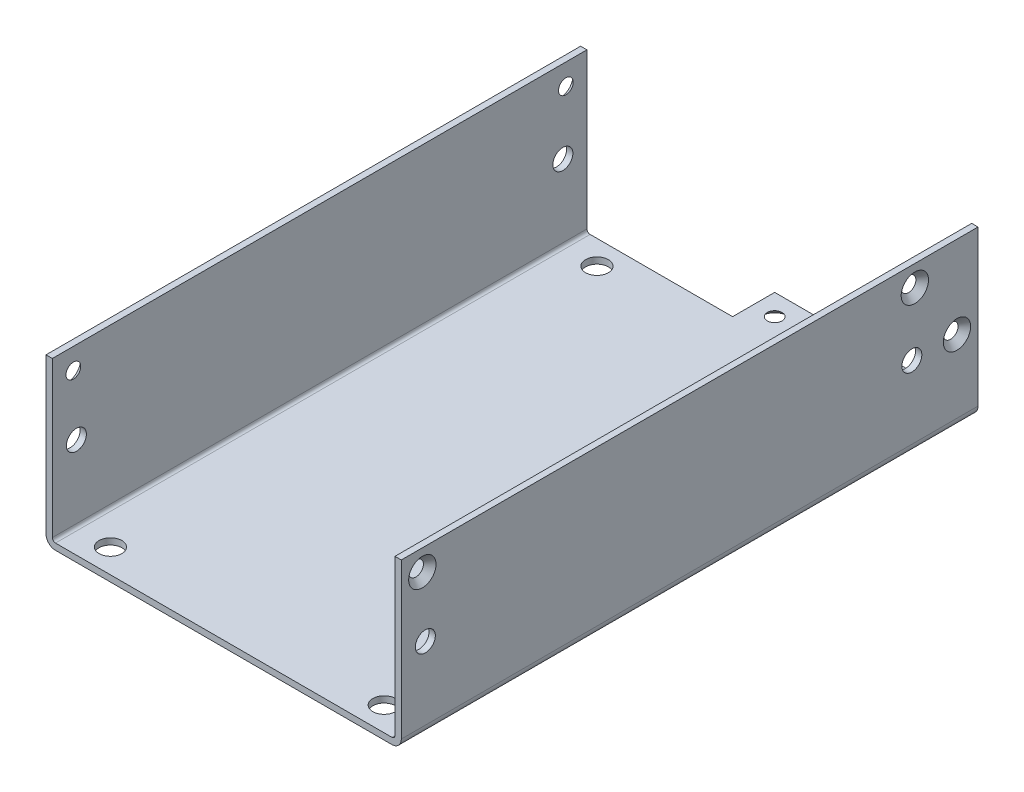
ISO-10303-21;
HEADER;
FILE_DESCRIPTION(('STEP AP214'),'2;1');
FILE_NAME('part.step','',(''),(''),'','','');
FILE_SCHEMA(('AUTOMOTIVE_DESIGN { 1 0 10303 214 1 1 1 1 }'));
ENDSEC;
DATA;
#1=APPLICATION_CONTEXT('core data for automotive mechanical design processes');
#2=APPLICATION_PROTOCOL_DEFINITION('international standard','automotive_design',2000,#1);
#3=PRODUCT_CONTEXT('',#1,'mechanical');
#4=PRODUCT('Part','Part','',(#3));
#5=PRODUCT_RELATED_PRODUCT_CATEGORY('part','',(#4));
#6=PRODUCT_DEFINITION_FORMATION('','',#4);
#7=PRODUCT_DEFINITION_CONTEXT('part definition',#1,'design');
#8=PRODUCT_DEFINITION('design','',#6,#7);
#9=PRODUCT_DEFINITION_SHAPE('','',#8);
#10=(LENGTH_UNIT() NAMED_UNIT(*) SI_UNIT(.MILLI.,.METRE.));
#11=(NAMED_UNIT(*) PLANE_ANGLE_UNIT() SI_UNIT($,.RADIAN.));
#12=(NAMED_UNIT(*) SI_UNIT($,.STERADIAN.) SOLID_ANGLE_UNIT());
#13=UNCERTAINTY_MEASURE_WITH_UNIT(LENGTH_MEASURE(1.E-05),#10,'distance_accuracy_value','');
#14=(GEOMETRIC_REPRESENTATION_CONTEXT(3) GLOBAL_UNCERTAINTY_ASSIGNED_CONTEXT((#13)) GLOBAL_UNIT_ASSIGNED_CONTEXT((#10,
#11,#12)) REPRESENTATION_CONTEXT('',''));
#15=CARTESIAN_POINT('',(0.,0.,0.));
#16=DIRECTION('',(0.,0.,1.));
#17=DIRECTION('',(1.,0.,0.));
#18=AXIS2_PLACEMENT_3D('',#15,#16,#17);
#19=CARTESIAN_POINT('',(-42.2,-29.1000000000002,127.));
#20=DIRECTION('',(0.,1.,0.));
#21=DIRECTION('',(0.,0.,1.));
#22=AXIS2_PLACEMENT_3D('',#19,#20,#21);
#23=PLANE('',#22);
#24=CARTESIAN_POINT('',(-1.09999999999999,-29.099999999922,-5.));
#25=DIRECTION('',(0.,-1.,0.));
#26=DIRECTION('',(0.,0.,-1.));
#27=AXIS2_PLACEMENT_3D('',#24,#25,#26);
#28=CIRCLE('',#27,1.74999999995406);
#29=CARTESIAN_POINT('',(-1.09999999999999,-29.099999999922,-6.74999999995406));
#30=VERTEX_POINT('',#29);
#31=EDGE_CURVE('E11',#30,#30,#28,.T.);
#32=ORIENTED_EDGE('',*,*,#31,.T.);
#33=EDGE_LOOP('',(#32));
#34=FACE_BOUND('',#33,.T.);
#35=CARTESIAN_POINT('',(-32.6,-29.1000000000002,5.71500000000001));
#36=DIRECTION('',(0.,-1.,0.));
#37=DIRECTION('',(0.,0.,1.));
#38=AXIS2_PLACEMENT_3D('',#35,#36,#37);
#39=CIRCLE('',#38,2.70000000000001);
#40=CARTESIAN_POINT('',(-32.6,-29.1000000000002,8.41500000000002));
#41=VERTEX_POINT('',#40);
#42=EDGE_CURVE('E27',#41,#41,#39,.T.);
#43=ORIENTED_EDGE('',*,*,#42,.T.);
#44=EDGE_LOOP('',(#43));
#45=FACE_BOUND('',#44,.T.);
#46=CARTESIAN_POINT('',(-32.6,-29.1000000000002,121.285));
#47=DIRECTION('',(0.,-1.,0.));
#48=DIRECTION('',(0.,0.,1.));
#49=AXIS2_PLACEMENT_3D('',#46,#47,#48);
#50=CIRCLE('',#49,2.69999999999999);
#51=CARTESIAN_POINT('',(-32.6,-29.1000000000002,123.985));
#52=VERTEX_POINT('',#51);
#53=EDGE_CURVE('E319',#52,#52,#50,.T.);
#54=ORIENTED_EDGE('',*,*,#53,.T.);
#55=EDGE_LOOP('',(#54));
#56=FACE_BOUND('',#55,.T.);
#57=CARTESIAN_POINT('',(32.42,-29.1000000000002,121.285));
#58=DIRECTION('',(0.,-1.,0.));
#59=DIRECTION('',(0.,0.,1.));
#60=AXIS2_PLACEMENT_3D('',#57,#58,#59);
#61=CIRCLE('',#60,2.69999999999999);
#62=CARTESIAN_POINT('',(32.42,-29.1000000000002,123.985));
#63=VERTEX_POINT('',#62);
#64=EDGE_CURVE('E323',#63,#63,#61,.T.);
#65=ORIENTED_EDGE('',*,*,#64,.T.);
#66=EDGE_LOOP('',(#65));
#67=FACE_BOUND('',#66,.T.);
#68=CARTESIAN_POINT('',(32.42,-29.1000000000002,5.71500000000001));
#69=DIRECTION('',(0.,-1.,0.));
#70=DIRECTION('',(0.,0.,1.));
#71=AXIS2_PLACEMENT_3D('',#68,#69,#70);
#72=CIRCLE('',#71,2.7);
#73=CARTESIAN_POINT('',(32.42,-29.1000000000002,8.41500000000001));
#74=VERTEX_POINT('',#73);
#75=EDGE_CURVE('E320',#74,#74,#72,.T.);
#76=ORIENTED_EDGE('',*,*,#75,.T.);
#77=EDGE_LOOP('',(#76));
#78=FACE_BOUND('',#77,.T.);
#79=DIRECTION('',(-1.,0.,0.));
#80=VECTOR('',#79,1.);
#81=CARTESIAN_POINT('',(-42.2,-29.1000000000002,-10.));
#82=LINE('',#81,#80);
#83=CARTESIAN_POINT('',(39.95,-29.1000000000002,-10.));
#84=VERTEX_POINT('',#83);
#85=CARTESIAN_POINT('',(-6.09999999999999,-29.1000000000002,-10.));
#86=VERTEX_POINT('',#85);
#87=EDGE_CURVE('E324',#84,#86,#82,.T.);
#88=ORIENTED_EDGE('',*,*,#87,.T.);
#89=DIRECTION('',(0.,0.,1.));
#90=VECTOR('',#89,1.);
#91=CARTESIAN_POINT('',(-6.09999999999999,-29.1000000000002,127.));
#92=LINE('',#91,#90);
#93=CARTESIAN_POINT('',(-6.09999999999999,-29.1000000000002,0.));
#94=VERTEX_POINT('',#93);
#95=EDGE_CURVE('E403',#86,#94,#92,.T.);
#96=ORIENTED_EDGE('',*,*,#95,.T.);
#97=DIRECTION('',(-1.,0.,0.));
#98=VECTOR('',#97,1.);
#99=CARTESIAN_POINT('',(-42.2,-29.1000000000002,0.));
#100=LINE('',#99,#98);
#101=CARTESIAN_POINT('',(-39.95,-29.1000000000002,0.));
#102=VERTEX_POINT('',#101);
#103=EDGE_CURVE('E343',#94,#102,#100,.T.);
#104=ORIENTED_EDGE('',*,*,#103,.T.);
#105=DIRECTION('',(0.,0.,1.));
#106=VECTOR('',#105,1.);
#107=CARTESIAN_POINT('',(-39.95,-29.1000000000002,127.));
#108=LINE('',#107,#106);
#109=CARTESIAN_POINT('',(-39.95,-29.1000000000002,127.));
#110=VERTEX_POINT('',#109);
#111=EDGE_CURVE('E340',#102,#110,#108,.T.);
#112=ORIENTED_EDGE('',*,*,#111,.T.);
#113=DIRECTION('',(1.,0.,0.));
#114=VECTOR('',#113,1.);
#115=CARTESIAN_POINT('',(-42.2,-29.1000000000002,127.));
#116=LINE('',#115,#114);
#117=CARTESIAN_POINT('',(39.95,-29.1000000000002,127.));
#118=VERTEX_POINT('',#117);
#119=EDGE_CURVE('E149',#110,#118,#116,.T.);
#120=ORIENTED_EDGE('',*,*,#119,.T.);
#121=DIRECTION('',(0.,0.,-1.));
#122=VECTOR('',#121,1.);
#123=CARTESIAN_POINT('',(39.95,-29.1000000000002,127.));
#124=LINE('',#123,#122);
#125=EDGE_CURVE('E138',#118,#84,#124,.T.);
#126=ORIENTED_EDGE('',*,*,#125,.T.);
#127=EDGE_LOOP('',(#88,#96,#104,#112,#120,#126));
#128=FACE_BOUND('',#127,.T.);
#129=ADVANCED_FACE('F17',(#34,#45,#56,#67,#78,#128),#23,.T.);
#130=CARTESIAN_POINT('',(-6.1,288.094010031715,-72.1425779960889));
#131=DIRECTION('',(-1.,0.,0.));
#132=DIRECTION('',(0.,0.,1.));
#133=AXIS2_PLACEMENT_3D('',#130,#131,#132);
#134=PLANE('',#133);
#135=DIRECTION('',(0.,0.,-1.));
#136=VECTOR('',#135,1.);
#137=CARTESIAN_POINT('',(-6.1,-30.6000000000002,-72.1425779960889));
#138=LINE('',#137,#136);
#139=CARTESIAN_POINT('',(-6.09999999999999,-30.6000000000002,0.));
#140=VERTEX_POINT('',#139);
#141=CARTESIAN_POINT('',(-6.09999999999999,-30.6000000000002,-10.));
#142=VERTEX_POINT('',#141);
#143=EDGE_CURVE('E154',#140,#142,#138,.T.);
#144=ORIENTED_EDGE('',*,*,#143,.F.);
#145=DIRECTION('',(0.,-1.,0.));
#146=VECTOR('',#145,1.);
#147=CARTESIAN_POINT('',(-6.1,288.094010031715,0.));
#148=LINE('',#147,#146);
#149=EDGE_CURVE('E347',#94,#140,#148,.T.);
#150=ORIENTED_EDGE('',*,*,#149,.F.);
#151=ORIENTED_EDGE('',*,*,#95,.F.);
#152=DIRECTION('',(0.,1.,0.));
#153=VECTOR('',#152,1.);
#154=CARTESIAN_POINT('',(-6.1,288.094010031715,-9.99999999999999));
#155=LINE('',#154,#153);
#156=EDGE_CURVE('E36',#142,#86,#155,.T.);
#157=ORIENTED_EDGE('',*,*,#156,.F.);
#158=EDGE_LOOP('',(#144,#150,#151,#157));
#159=FACE_BOUND('',#158,.T.);
#160=ADVANCED_FACE('F232',(#159),#134,.T.);
#161=CARTESIAN_POINT('',(-6.09999999999999,288.094010031715,-9.99999999999999));
#162=DIRECTION('',(0.,0.,-1.));
#163=DIRECTION('',(-1.,0.,0.));
#164=AXIS2_PLACEMENT_3D('',#161,#162,#163);
#165=PLANE('',#164);
#166=ORIENTED_EDGE('',*,*,#87,.F.);
#167=CARTESIAN_POINT('',(39.95,-28.3500000000002,-10.));
#168=DIRECTION('',(0.,0.,1.));
#169=DIRECTION('',(-1.,0.,0.));
#170=AXIS2_PLACEMENT_3D('',#167,#168,#169);
#171=CIRCLE('',#170,0.749999999999994);
#172=CARTESIAN_POINT('',(40.7,-28.3500000000002,-10.));
#173=VERTEX_POINT('',#172);
#174=EDGE_CURVE('E97',#84,#173,#171,.T.);
#175=ORIENTED_EDGE('',*,*,#174,.T.);
#176=DIRECTION('',(0.,-1.,0.));
#177=VECTOR('',#176,1.);
#178=CARTESIAN_POINT('',(40.7,-30.6000000000002,-10.));
#179=LINE('',#178,#177);
#180=CARTESIAN_POINT('',(40.7,8.49999999999979,-10.));
#181=VERTEX_POINT('',#180);
#182=EDGE_CURVE('E143',#181,#173,#179,.T.);
#183=ORIENTED_EDGE('',*,*,#182,.F.);
#184=DIRECTION('',(1.,0.,0.));
#185=VECTOR('',#184,1.);
#186=CARTESIAN_POINT('',(-243.038770702913,8.49999999999979,-10.));
#187=LINE('',#186,#185);
#188=CARTESIAN_POINT('',(42.2,8.49999999999979,-10.));
#189=VERTEX_POINT('',#188);
#190=EDGE_CURVE('E316',#181,#189,#187,.T.);
#191=ORIENTED_EDGE('',*,*,#190,.T.);
#192=DIRECTION('',(0.,-1.,0.));
#193=VECTOR('',#192,1.);
#194=CARTESIAN_POINT('',(42.2,-29.1000000000002,-10.));
#195=LINE('',#194,#193);
#196=CARTESIAN_POINT('',(42.2,-28.3500000000002,-10.));
#197=VERTEX_POINT('',#196);
#198=EDGE_CURVE('E406',#189,#197,#195,.T.);
#199=ORIENTED_EDGE('',*,*,#198,.T.);
#200=CARTESIAN_POINT('',(39.95,-28.3500000000002,-10.));
#201=DIRECTION('',(0.,0.,1.));
#202=DIRECTION('',(-1.,0.,0.));
#203=AXIS2_PLACEMENT_3D('',#200,#201,#202);
#204=CIRCLE('',#203,2.25);
#205=CARTESIAN_POINT('',(39.95,-30.6000000000002,-10.));
#206=VERTEX_POINT('',#205);
#207=EDGE_CURVE('E359',#206,#197,#204,.T.);
#208=ORIENTED_EDGE('',*,*,#207,.F.);
#209=DIRECTION('',(-1.,0.,0.));
#210=VECTOR('',#209,1.);
#211=CARTESIAN_POINT('',(-6.09999999999999,-30.6000000000002,-9.99999999999999));
#212=LINE('',#211,#210);
#213=EDGE_CURVE('E409',#206,#142,#212,.T.);
#214=ORIENTED_EDGE('',*,*,#213,.T.);
#215=ORIENTED_EDGE('',*,*,#156,.T.);
#216=EDGE_LOOP('',(#166,#175,#183,#191,#199,#208,#214,#215));
#217=FACE_BOUND('',#216,.T.);
#218=ADVANCED_FACE('F195',(#217),#165,.T.);
#219=CARTESIAN_POINT('',(39.95,-28.3500000000002,335.827721220174));
#220=DIRECTION('',(0.,0.,1.));
#221=DIRECTION('',(1.,0.,0.));
#222=AXIS2_PLACEMENT_3D('',#219,#220,#221);
#223=CYLINDRICAL_SURFACE('',#222,0.749999999999994);
#224=DIRECTION('',(0.,0.,1.));
#225=VECTOR('',#224,1.);
#226=CARTESIAN_POINT('',(40.7,-28.3500000000002,335.827721220174));
#227=LINE('',#226,#225);
#228=CARTESIAN_POINT('',(40.7,-28.3500000000002,127.));
#229=VERTEX_POINT('',#228);
#230=EDGE_CURVE('E133',#173,#229,#227,.T.);
#231=ORIENTED_EDGE('',*,*,#230,.F.);
#232=ORIENTED_EDGE('',*,*,#174,.F.);
#233=ORIENTED_EDGE('',*,*,#125,.F.);
#234=CARTESIAN_POINT('',(39.95,-28.3500000000002,127.));
#235=DIRECTION('',(0.,0.,-1.));
#236=DIRECTION('',(-1.,0.,0.));
#237=AXIS2_PLACEMENT_3D('',#234,#235,#236);
#238=CIRCLE('',#237,0.749999999999994);
#239=EDGE_CURVE('E104',#229,#118,#238,.T.);
#240=ORIENTED_EDGE('',*,*,#239,.F.);
#241=EDGE_LOOP('',(#231,#232,#233,#240));
#242=FACE_BOUND('',#241,.T.);
#243=ADVANCED_FACE('F136',(#242),#223,.F.);
#244=CARTESIAN_POINT('',(-42.2,288.094010031715,127.));
#245=DIRECTION('',(0.,0.,1.));
#246=DIRECTION('',(1.,0.,0.));
#247=AXIS2_PLACEMENT_3D('',#244,#245,#246);
#248=PLANE('',#247);
#249=DIRECTION('',(-1.,0.,0.));
#250=VECTOR('',#249,1.);
#251=CARTESIAN_POINT('',(-42.2,-30.6000000000002,127.));
#252=LINE('',#251,#250);
#253=CARTESIAN_POINT('',(39.95,-30.6000000000002,127.));
#254=VERTEX_POINT('',#253);
#255=CARTESIAN_POINT('',(-39.95,-30.6000000000002,127.));
#256=VERTEX_POINT('',#255);
#257=EDGE_CURVE('E151',#254,#256,#252,.T.);
#258=ORIENTED_EDGE('',*,*,#257,.F.);
#259=CARTESIAN_POINT('',(39.95,-28.3500000000002,127.));
#260=DIRECTION('',(0.,0.,-1.));
#261=DIRECTION('',(-1.,0.,0.));
#262=AXIS2_PLACEMENT_3D('',#259,#260,#261);
#263=CIRCLE('',#262,2.25);
#264=CARTESIAN_POINT('',(42.2,-28.3500000000002,127.));
#265=VERTEX_POINT('',#264);
#266=EDGE_CURVE('E371',#265,#254,#263,.T.);
#267=ORIENTED_EDGE('',*,*,#266,.F.);
#268=DIRECTION('',(0.,-1.,0.));
#269=VECTOR('',#268,1.);
#270=CARTESIAN_POINT('',(42.2,-30.6000000000002,127.));
#271=LINE('',#270,#269);
#272=CARTESIAN_POINT('',(42.2,8.49999999999979,127.));
#273=VERTEX_POINT('',#272);
#274=EDGE_CURVE('E377',#273,#265,#271,.T.);
#275=ORIENTED_EDGE('',*,*,#274,.F.);
#276=DIRECTION('',(-1.,0.,0.));
#277=VECTOR('',#276,1.);
#278=CARTESIAN_POINT('',(-243.038770702913,8.49999999999979,127.));
#279=LINE('',#278,#277);
#280=CARTESIAN_POINT('',(40.7,8.4999999999998,127.));
#281=VERTEX_POINT('',#280);
#282=EDGE_CURVE('E128',#273,#281,#279,.T.);
#283=ORIENTED_EDGE('',*,*,#282,.T.);
#284=DIRECTION('',(0.,1.,0.));
#285=VECTOR('',#284,1.);
#286=CARTESIAN_POINT('',(40.7,-30.6000000000002,127.));
#287=LINE('',#286,#285);
#288=EDGE_CURVE('E123',#229,#281,#287,.T.);
#289=ORIENTED_EDGE('',*,*,#288,.F.);
#290=ORIENTED_EDGE('',*,*,#239,.T.);
#291=ORIENTED_EDGE('',*,*,#119,.F.);
#292=CARTESIAN_POINT('',(-39.95,-28.3500000000002,127.));
#293=DIRECTION('',(0.,0.,-1.));
#294=DIRECTION('',(1.,0.,0.));
#295=AXIS2_PLACEMENT_3D('',#292,#293,#294);
#296=CIRCLE('',#295,0.749999999999994);
#297=CARTESIAN_POINT('',(-40.7,-28.3500000000002,127.));
#298=VERTEX_POINT('',#297);
#299=EDGE_CURVE('E140',#110,#298,#296,.T.);
#300=ORIENTED_EDGE('',*,*,#299,.T.);
#301=DIRECTION('',(0.,-1.,0.));
#302=VECTOR('',#301,1.);
#303=CARTESIAN_POINT('',(-40.7,-30.6000000000002,127.));
#304=LINE('',#303,#302);
#305=CARTESIAN_POINT('',(-40.7,8.4999999999998,127.));
#306=VERTEX_POINT('',#305);
#307=EDGE_CURVE('E325',#306,#298,#304,.T.);
#308=ORIENTED_EDGE('',*,*,#307,.F.);
#309=DIRECTION('',(1.,0.,0.));
#310=VECTOR('',#309,1.);
#311=CARTESIAN_POINT('',(223.776256023107,8.4999999999998,127.));
#312=LINE('',#311,#310);
#313=CARTESIAN_POINT('',(-42.2,8.4999999999998,127.));
#314=VERTEX_POINT('',#313);
#315=EDGE_CURVE('E424',#314,#306,#312,.T.);
#316=ORIENTED_EDGE('',*,*,#315,.F.);
#317=DIRECTION('',(0.,1.,0.));
#318=VECTOR('',#317,1.);
#319=CARTESIAN_POINT('',(-42.2,-30.6000000000002,127.));
#320=LINE('',#319,#318);
#321=CARTESIAN_POINT('',(-42.2,-28.3500000000002,127.));
#322=VERTEX_POINT('',#321);
#323=EDGE_CURVE('E302',#322,#314,#320,.T.);
#324=ORIENTED_EDGE('',*,*,#323,.F.);
#325=CARTESIAN_POINT('',(-39.95,-28.3500000000002,127.));
#326=DIRECTION('',(0.,0.,-1.));
#327=DIRECTION('',(1.,0.,0.));
#328=AXIS2_PLACEMENT_3D('',#325,#326,#327);
#329=CIRCLE('',#328,2.25);
#330=EDGE_CURVE('E307',#256,#322,#329,.T.);
#331=ORIENTED_EDGE('',*,*,#330,.F.);
#332=EDGE_LOOP('',(#258,#267,#275,#283,#289,#290,#291,#300,#308,#316,#324,#331));
#333=FACE_BOUND('',#332,.T.);
#334=ADVANCED_FACE('F125',(#333),#248,.T.);
#335=CARTESIAN_POINT('',(-39.95,-28.3500000000002,-186.91928942729));
#336=DIRECTION('',(0.,0.,-1.));
#337=DIRECTION('',(-1.,0.,0.));
#338=AXIS2_PLACEMENT_3D('',#335,#336,#337);
#339=CYLINDRICAL_SURFACE('',#338,0.749999999999994);
#340=DIRECTION('',(0.,0.,-1.));
#341=VECTOR('',#340,1.);
#342=CARTESIAN_POINT('',(-40.7,-28.3500000000002,-186.91928942729));
#343=LINE('',#342,#341);
#344=CARTESIAN_POINT('',(-40.7,-28.3500000000002,0.));
#345=VERTEX_POINT('',#344);
#346=EDGE_CURVE('E329',#298,#345,#343,.T.);
#347=ORIENTED_EDGE('',*,*,#346,.F.);
#348=ORIENTED_EDGE('',*,*,#299,.F.);
#349=ORIENTED_EDGE('',*,*,#111,.F.);
#350=CARTESIAN_POINT('',(-39.95,-28.3500000000002,0.));
#351=DIRECTION('',(0.,0.,1.));
#352=DIRECTION('',(1.,0.,0.));
#353=AXIS2_PLACEMENT_3D('',#350,#351,#352);
#354=CIRCLE('',#353,0.749999999999994);
#355=EDGE_CURVE('E405',#345,#102,#354,.T.);
#356=ORIENTED_EDGE('',*,*,#355,.F.);
#357=EDGE_LOOP('',(#347,#348,#349,#356));
#358=FACE_BOUND('',#357,.T.);
#359=ADVANCED_FACE('F196',(#358),#339,.F.);
#360=CARTESIAN_POINT('',(-42.2,288.094010031715,0.));
#361=DIRECTION('',(0.,0.,-1.));
#362=DIRECTION('',(-1.,0.,0.));
#363=AXIS2_PLACEMENT_3D('',#360,#361,#362);
#364=PLANE('',#363);
#365=ORIENTED_EDGE('',*,*,#103,.F.);
#366=ORIENTED_EDGE('',*,*,#149,.T.);
#367=DIRECTION('',(-1.,0.,0.));
#368=VECTOR('',#367,1.);
#369=CARTESIAN_POINT('',(-42.2,-30.6000000000002,0.));
#370=LINE('',#369,#368);
#371=CARTESIAN_POINT('',(-39.95,-30.6000000000002,0.));
#372=VERTEX_POINT('',#371);
#373=EDGE_CURVE('E344',#140,#372,#370,.T.);
#374=ORIENTED_EDGE('',*,*,#373,.T.);
#375=CARTESIAN_POINT('',(-39.95,-28.3500000000002,0.));
#376=DIRECTION('',(0.,0.,1.));
#377=DIRECTION('',(1.,0.,0.));
#378=AXIS2_PLACEMENT_3D('',#375,#376,#377);
#379=CIRCLE('',#378,2.25);
#380=CARTESIAN_POINT('',(-42.2,-28.3500000000002,0.));
#381=VERTEX_POINT('',#380);
#382=EDGE_CURVE('E308',#381,#372,#379,.T.);
#383=ORIENTED_EDGE('',*,*,#382,.F.);
#384=DIRECTION('',(0.,1.,0.));
#385=VECTOR('',#384,1.);
#386=CARTESIAN_POINT('',(-42.2,-30.6000000000002,0.));
#387=LINE('',#386,#385);
#388=CARTESIAN_POINT('',(-42.2,8.4999999999998,0.));
#389=VERTEX_POINT('',#388);
#390=EDGE_CURVE('E305',#381,#389,#387,.T.);
#391=ORIENTED_EDGE('',*,*,#390,.T.);
#392=DIRECTION('',(-1.,0.,0.));
#393=VECTOR('',#392,1.);
#394=CARTESIAN_POINT('',(223.776256023107,8.4999999999998,0.));
#395=LINE('',#394,#393);
#396=CARTESIAN_POINT('',(-40.7,8.4999999999998,0.));
#397=VERTEX_POINT('',#396);
#398=EDGE_CURVE('E330',#397,#389,#395,.T.);
#399=ORIENTED_EDGE('',*,*,#398,.F.);
#400=DIRECTION('',(0.,1.,0.));
#401=VECTOR('',#400,1.);
#402=CARTESIAN_POINT('',(-40.7,-30.6000000000002,0.));
#403=LINE('',#402,#401);
#404=EDGE_CURVE('E310',#345,#397,#403,.T.);
#405=ORIENTED_EDGE('',*,*,#404,.F.);
#406=ORIENTED_EDGE('',*,*,#355,.T.);
#407=EDGE_LOOP('',(#365,#366,#374,#383,#391,#399,#405,#406));
#408=FACE_BOUND('',#407,.T.);
#409=ADVANCED_FACE('F199',(#408),#364,.T.);
#410=CARTESIAN_POINT('',(-42.2,-30.6000000000002,127.));
#411=DIRECTION('',(0.,-1.,0.));
#412=DIRECTION('',(0.,0.,-1.));
#413=AXIS2_PLACEMENT_3D('',#410,#411,#412);
#414=PLANE('',#413);
#415=CARTESIAN_POINT('',(-1.09999999999999,-30.5999999999434,-5.));
#416=DIRECTION('',(0.,1.,0.));
#417=DIRECTION('',(0.,0.,-1.));
#418=AXIS2_PLACEMENT_3D('',#415,#416,#417);
#419=CIRCLE('',#418,3.24999999997543);
#420=CARTESIAN_POINT('',(-1.09999999999999,-30.5999999999434,-8.24999999997544));
#421=VERTEX_POINT('',#420);
#422=EDGE_CURVE('E419',#421,#421,#419,.T.);
#423=ORIENTED_EDGE('',*,*,#422,.T.);
#424=EDGE_LOOP('',(#423));
#425=FACE_BOUND('',#424,.T.);
#426=CARTESIAN_POINT('',(-32.6,-30.6000000000002,5.71500000000001));
#427=DIRECTION('',(0.,1.,0.));
#428=DIRECTION('',(0.,0.,1.));
#429=AXIS2_PLACEMENT_3D('',#426,#427,#428);
#430=CIRCLE('',#429,2.70000000000001);
#431=CARTESIAN_POINT('',(-32.6,-30.6000000000002,8.41500000000002));
#432=VERTEX_POINT('',#431);
#433=EDGE_CURVE('E367',#432,#432,#430,.T.);
#434=ORIENTED_EDGE('',*,*,#433,.T.);
#435=EDGE_LOOP('',(#434));
#436=FACE_BOUND('',#435,.T.);
#437=CARTESIAN_POINT('',(-32.6,-30.6000000000002,121.285));
#438=DIRECTION('',(0.,1.,0.));
#439=DIRECTION('',(0.,0.,1.));
#440=AXIS2_PLACEMENT_3D('',#437,#438,#439);
#441=CIRCLE('',#440,2.69999999999999);
#442=CARTESIAN_POINT('',(-32.6,-30.6000000000002,123.985));
#443=VERTEX_POINT('',#442);
#444=EDGE_CURVE('E364',#443,#443,#441,.T.);
#445=ORIENTED_EDGE('',*,*,#444,.T.);
#446=EDGE_LOOP('',(#445));
#447=FACE_BOUND('',#446,.T.);
#448=CARTESIAN_POINT('',(32.42,-30.6000000000002,121.285));
#449=DIRECTION('',(0.,1.,0.));
#450=DIRECTION('',(0.,0.,1.));
#451=AXIS2_PLACEMENT_3D('',#448,#449,#450);
#452=CIRCLE('',#451,2.69999999999999);
#453=CARTESIAN_POINT('',(32.42,-30.6000000000002,123.985));
#454=VERTEX_POINT('',#453);
#455=EDGE_CURVE('E368',#454,#454,#452,.T.);
#456=ORIENTED_EDGE('',*,*,#455,.T.);
#457=EDGE_LOOP('',(#456));
#458=FACE_BOUND('',#457,.T.);
#459=CARTESIAN_POINT('',(32.42,-30.6000000000002,5.71500000000001));
#460=DIRECTION('',(0.,1.,0.));
#461=DIRECTION('',(0.,0.,1.));
#462=AXIS2_PLACEMENT_3D('',#459,#460,#461);
#463=CIRCLE('',#462,2.7);
#464=CARTESIAN_POINT('',(32.42,-30.6000000000002,8.41500000000001));
#465=VERTEX_POINT('',#464);
#466=EDGE_CURVE('E396',#465,#465,#463,.T.);
#467=ORIENTED_EDGE('',*,*,#466,.T.);
#468=EDGE_LOOP('',(#467));
#469=FACE_BOUND('',#468,.T.);
#470=ORIENTED_EDGE('',*,*,#373,.F.);
#471=ORIENTED_EDGE('',*,*,#143,.T.);
#472=ORIENTED_EDGE('',*,*,#213,.F.);
#473=DIRECTION('',(0.,0.,-1.));
#474=VECTOR('',#473,1.);
#475=CARTESIAN_POINT('',(39.95,-30.6000000000002,127.));
#476=LINE('',#475,#474);
#477=EDGE_CURVE('E333',#254,#206,#476,.T.);
#478=ORIENTED_EDGE('',*,*,#477,.F.);
#479=ORIENTED_EDGE('',*,*,#257,.T.);
#480=DIRECTION('',(0.,0.,1.));
#481=VECTOR('',#480,1.);
#482=CARTESIAN_POINT('',(-39.95,-30.6000000000002,127.));
#483=LINE('',#482,#481);
#484=EDGE_CURVE('E312',#372,#256,#483,.T.);
#485=ORIENTED_EDGE('',*,*,#484,.F.);
#486=EDGE_LOOP('',(#470,#471,#472,#478,#479,#485));
#487=FACE_BOUND('',#486,.T.);
#488=ADVANCED_FACE('F248',(#425,#436,#447,#458,#469,#487),#414,.T.);
#489=CARTESIAN_POINT('',(40.7,-30.6000000000002,127.));
#490=DIRECTION('',(-1.,0.,0.));
#491=DIRECTION('',(0.,0.,1.));
#492=AXIS2_PLACEMENT_3D('',#489,#490,#491);
#493=PLANE('',#492);
#494=CARTESIAN_POINT('',(40.7000000000767,-11.1000000000002,-5.));
#495=DIRECTION('',(1.,0.,0.));
#496=DIRECTION('',(0.,0.,-1.));
#497=AXIS2_PLACEMENT_3D('',#494,#495,#496);
#498=CIRCLE('',#497,1.75000000001546);
#499=CARTESIAN_POINT('',(40.7000000000767,-11.1000000000002,-6.75000000001546));
#500=VERTEX_POINT('',#499);
#501=EDGE_CURVE('E155',#500,#500,#498,.T.);
#502=ORIENTED_EDGE('',*,*,#501,.T.);
#503=EDGE_LOOP('',(#502));
#504=FACE_BOUND('',#503,.T.);
#505=CARTESIAN_POINT('',(40.7,-11.1000000000002,121.285));
#506=DIRECTION('',(1.,0.,0.));
#507=DIRECTION('',(0.,0.,1.));
#508=AXIS2_PLACEMENT_3D('',#505,#506,#507);
#509=CIRCLE('',#508,2.375);
#510=CARTESIAN_POINT('',(40.7,-11.1000000000002,123.66));
#511=VERTEX_POINT('',#510);
#512=EDGE_CURVE('E338',#511,#511,#509,.T.);
#513=ORIENTED_EDGE('',*,*,#512,.T.);
#514=EDGE_LOOP('',(#513));
#515=FACE_BOUND('',#514,.T.);
#516=CARTESIAN_POINT('',(40.7,-11.1000000000002,5.71500000000001));
#517=DIRECTION('',(1.,0.,0.));
#518=DIRECTION('',(0.,0.,1.));
#519=AXIS2_PLACEMENT_3D('',#516,#517,#518);
#520=CIRCLE('',#519,2.375);
#521=CARTESIAN_POINT('',(40.7,-11.1000000000002,8.09000000000001));
#522=VERTEX_POINT('',#521);
#523=EDGE_CURVE('E335',#522,#522,#520,.T.);
#524=ORIENTED_EDGE('',*,*,#523,.T.);
#525=EDGE_LOOP('',(#524));
#526=FACE_BOUND('',#525,.T.);
#527=CARTESIAN_POINT('',(40.6999999999584,3.49999999999981,5.00000000000001));
#528=DIRECTION('',(1.,0.,0.));
#529=DIRECTION('',(0.,0.,-1.));
#530=AXIS2_PLACEMENT_3D('',#527,#528,#529);
#531=CIRCLE('',#530,1.75000000002001);
#532=CARTESIAN_POINT('',(40.6999999999584,3.49999999999981,3.24999999998));
#533=VERTEX_POINT('',#532);
#534=EDGE_CURVE('E339',#533,#533,#531,.T.);
#535=ORIENTED_EDGE('',*,*,#534,.T.);
#536=EDGE_LOOP('',(#535));
#537=FACE_BOUND('',#536,.T.);
#538=CARTESIAN_POINT('',(40.6999999999584,3.49999999999981,122.));
#539=DIRECTION('',(1.,0.,0.));
#540=DIRECTION('',(0.,0.,-1.));
#541=AXIS2_PLACEMENT_3D('',#538,#539,#540);
#542=CIRCLE('',#541,1.7500000000582);
#543=CARTESIAN_POINT('',(40.6999999999584,3.49999999999981,120.249999999942));
#544=VERTEX_POINT('',#543);
#545=EDGE_CURVE('E349',#544,#544,#542,.T.);
#546=ORIENTED_EDGE('',*,*,#545,.T.);
#547=EDGE_LOOP('',(#546));
#548=FACE_BOUND('',#547,.T.);
#549=DIRECTION('',(0.,0.,-1.));
#550=VECTOR('',#549,1.);
#551=CARTESIAN_POINT('',(40.7,8.4999999999998,127.));
#552=LINE('',#551,#550);
#553=EDGE_CURVE('E145',#281,#181,#552,.T.);
#554=ORIENTED_EDGE('',*,*,#553,.T.);
#555=ORIENTED_EDGE('',*,*,#182,.T.);
#556=ORIENTED_EDGE('',*,*,#230,.T.);
#557=ORIENTED_EDGE('',*,*,#288,.T.);
#558=EDGE_LOOP('',(#554,#555,#556,#557));
#559=FACE_BOUND('',#558,.T.);
#560=ADVANCED_FACE('F142',(#504,#515,#526,#537,#548,#559),#493,.T.);
#561=CARTESIAN_POINT('',(-40.7,-30.6000000000002,127.));
#562=DIRECTION('',(1.,0.,0.));
#563=DIRECTION('',(0.,0.,-1.));
#564=AXIS2_PLACEMENT_3D('',#561,#562,#563);
#565=PLANE('',#564);
#566=CARTESIAN_POINT('',(-40.7,-11.1000000000002,121.285));
#567=DIRECTION('',(-1.,0.,0.));
#568=DIRECTION('',(0.,0.,1.));
#569=AXIS2_PLACEMENT_3D('',#566,#567,#568);
#570=CIRCLE('',#569,2.375);
#571=CARTESIAN_POINT('',(-40.7,-11.1000000000002,123.66));
#572=VERTEX_POINT('',#571);
#573=EDGE_CURVE('E134',#572,#572,#570,.T.);
#574=ORIENTED_EDGE('',*,*,#573,.T.);
#575=EDGE_LOOP('',(#574));
#576=FACE_BOUND('',#575,.T.);
#577=CARTESIAN_POINT('',(-40.7,-11.1000000000002,5.71500000000001));
#578=DIRECTION('',(-1.,0.,0.));
#579=DIRECTION('',(0.,0.,1.));
#580=AXIS2_PLACEMENT_3D('',#577,#578,#579);
#581=CIRCLE('',#580,2.375);
#582=CARTESIAN_POINT('',(-40.7,-11.1000000000002,8.09000000000001));
#583=VERTEX_POINT('',#582);
#584=EDGE_CURVE('E355',#583,#583,#581,.T.);
#585=ORIENTED_EDGE('',*,*,#584,.T.);
#586=EDGE_LOOP('',(#585));
#587=FACE_BOUND('',#586,.T.);
#588=CARTESIAN_POINT('',(-40.7000000000153,3.49999999999981,122.));
#589=DIRECTION('',(-1.,0.,0.));
#590=DIRECTION('',(0.,0.,1.));
#591=AXIS2_PLACEMENT_3D('',#588,#589,#590);
#592=CIRCLE('',#591,1.75000000002956);
#593=CARTESIAN_POINT('',(-40.7000000000153,3.49999999999981,123.75000000003));
#594=VERTEX_POINT('',#593);
#595=EDGE_CURVE('E381',#594,#594,#592,.T.);
#596=ORIENTED_EDGE('',*,*,#595,.T.);
#597=EDGE_LOOP('',(#596));
#598=FACE_BOUND('',#597,.T.);
#599=CARTESIAN_POINT('',(-40.6999999999584,3.49999999999981,5.00000000000001));
#600=DIRECTION('',(-1.,0.,0.));
#601=DIRECTION('',(0.,0.,1.));
#602=AXIS2_PLACEMENT_3D('',#599,#600,#601);
#603=CIRCLE('',#602,1.74999999995407);
#604=CARTESIAN_POINT('',(-40.6999999999584,3.49999999999981,6.74999999995408));
#605=VERTEX_POINT('',#604);
#606=EDGE_CURVE('E376',#605,#605,#603,.T.);
#607=ORIENTED_EDGE('',*,*,#606,.T.);
#608=EDGE_LOOP('',(#607));
#609=FACE_BOUND('',#608,.T.);
#610=DIRECTION('',(0.,0.,1.));
#611=VECTOR('',#610,1.);
#612=CARTESIAN_POINT('',(-40.7,8.4999999999998,127.));
#613=LINE('',#612,#611);
#614=EDGE_CURVE('E328',#397,#306,#613,.T.);
#615=ORIENTED_EDGE('',*,*,#614,.T.);
#616=ORIENTED_EDGE('',*,*,#307,.T.);
#617=ORIENTED_EDGE('',*,*,#346,.T.);
#618=ORIENTED_EDGE('',*,*,#404,.T.);
#619=EDGE_LOOP('',(#615,#616,#617,#618));
#620=FACE_BOUND('',#619,.T.);
#621=ADVANCED_FACE('F255',(#576,#587,#598,#609,#620),#565,.T.);
#622=CARTESIAN_POINT('',(-39.95,-28.3500000000002,-186.91928942729));
#623=DIRECTION('',(0.,0.,-1.));
#624=DIRECTION('',(-1.,0.,0.));
#625=AXIS2_PLACEMENT_3D('',#622,#623,#624);
#626=CYLINDRICAL_SURFACE('',#625,2.25);
#627=ORIENTED_EDGE('',*,*,#330,.T.);
#628=DIRECTION('',(0.,0.,-1.));
#629=VECTOR('',#628,1.);
#630=CARTESIAN_POINT('',(-42.2,-28.3500000000002,-186.91928942729));
#631=LINE('',#630,#629);
#632=EDGE_CURVE('E301',#322,#381,#631,.T.);
#633=ORIENTED_EDGE('',*,*,#632,.T.);
#634=ORIENTED_EDGE('',*,*,#382,.T.);
#635=ORIENTED_EDGE('',*,*,#484,.T.);
#636=EDGE_LOOP('',(#627,#633,#634,#635));
#637=FACE_BOUND('',#636,.T.);
#638=ADVANCED_FACE('F259',(#637),#626,.T.);
#639=CARTESIAN_POINT('',(39.95,-28.3500000000002,335.827721220174));
#640=DIRECTION('',(0.,0.,1.));
#641=DIRECTION('',(1.,0.,0.));
#642=AXIS2_PLACEMENT_3D('',#639,#640,#641);
#643=CYLINDRICAL_SURFACE('',#642,2.25);
#644=ORIENTED_EDGE('',*,*,#207,.T.);
#645=DIRECTION('',(0.,0.,1.));
#646=VECTOR('',#645,1.);
#647=CARTESIAN_POINT('',(42.2,-28.3500000000002,335.827721220174));
#648=LINE('',#647,#646);
#649=EDGE_CURVE('E362',#197,#265,#648,.T.);
#650=ORIENTED_EDGE('',*,*,#649,.T.);
#651=ORIENTED_EDGE('',*,*,#266,.T.);
#652=ORIENTED_EDGE('',*,*,#477,.T.);
#653=EDGE_LOOP('',(#644,#650,#651,#652));
#654=FACE_BOUND('',#653,.T.);
#655=ADVANCED_FACE('F263',(#654),#643,.T.);
#656=CARTESIAN_POINT('',(-243.038770702913,8.49999999999979,127.));
#657=DIRECTION('',(0.,1.,0.));
#658=DIRECTION('',(0.,0.,1.));
#659=AXIS2_PLACEMENT_3D('',#656,#657,#658);
#660=PLANE('',#659);
#661=DIRECTION('',(0.,0.,1.));
#662=VECTOR('',#661,1.);
#663=CARTESIAN_POINT('',(42.2,8.49999999999979,127.));
#664=LINE('',#663,#662);
#665=EDGE_CURVE('E380',#189,#273,#664,.T.);
#666=ORIENTED_EDGE('',*,*,#665,.F.);
#667=ORIENTED_EDGE('',*,*,#190,.F.);
#668=ORIENTED_EDGE('',*,*,#553,.F.);
#669=ORIENTED_EDGE('',*,*,#282,.F.);
#670=EDGE_LOOP('',(#666,#667,#668,#669));
#671=FACE_BOUND('',#670,.T.);
#672=ADVANCED_FACE('F267',(#671),#660,.T.);
#673=CARTESIAN_POINT('',(223.776256023107,8.4999999999998,127.));
#674=DIRECTION('',(0.,1.,0.));
#675=DIRECTION('',(0.,0.,1.));
#676=AXIS2_PLACEMENT_3D('',#673,#674,#675);
#677=PLANE('',#676);
#678=ORIENTED_EDGE('',*,*,#614,.F.);
#679=ORIENTED_EDGE('',*,*,#398,.T.);
#680=DIRECTION('',(0.,0.,1.));
#681=VECTOR('',#680,1.);
#682=CARTESIAN_POINT('',(-42.2,8.4999999999998,127.));
#683=LINE('',#682,#681);
#684=EDGE_CURVE('E334',#389,#314,#683,.T.);
#685=ORIENTED_EDGE('',*,*,#684,.T.);
#686=ORIENTED_EDGE('',*,*,#315,.T.);
#687=EDGE_LOOP('',(#678,#679,#685,#686));
#688=FACE_BOUND('',#687,.T.);
#689=ADVANCED_FACE('F271',(#688),#677,.T.);
#690=CARTESIAN_POINT('',(-42.2,-30.6000000000002,127.));
#691=DIRECTION('',(-1.,0.,0.));
#692=DIRECTION('',(0.,0.,1.));
#693=AXIS2_PLACEMENT_3D('',#690,#691,#692);
#694=PLANE('',#693);
#695=CARTESIAN_POINT('',(-42.2,-11.1000000000002,121.285));
#696=DIRECTION('',(1.,0.,0.));
#697=DIRECTION('',(0.,0.,1.));
#698=AXIS2_PLACEMENT_3D('',#695,#696,#697);
#699=CIRCLE('',#698,2.375);
#700=CARTESIAN_POINT('',(-42.2,-11.1000000000002,123.66));
#701=VERTEX_POINT('',#700);
#702=EDGE_CURVE('E285',#701,#701,#699,.T.);
#703=ORIENTED_EDGE('',*,*,#702,.T.);
#704=EDGE_LOOP('',(#703));
#705=FACE_BOUND('',#704,.T.);
#706=CARTESIAN_POINT('',(-42.2,-11.1000000000002,5.71500000000001));
#707=DIRECTION('',(1.,0.,0.));
#708=DIRECTION('',(0.,0.,1.));
#709=AXIS2_PLACEMENT_3D('',#706,#707,#708);
#710=CIRCLE('',#709,2.375);
#711=CARTESIAN_POINT('',(-42.2,-11.1000000000002,8.09000000000001));
#712=VERTEX_POINT('',#711);
#713=EDGE_CURVE('E289',#712,#712,#710,.T.);
#714=ORIENTED_EDGE('',*,*,#713,.T.);
#715=EDGE_LOOP('',(#714));
#716=FACE_BOUND('',#715,.T.);
#717=CARTESIAN_POINT('',(-42.1999999999798,3.49999999999981,122.));
#718=DIRECTION('',(1.,0.,0.));
#719=DIRECTION('',(0.,0.,1.));
#720=AXIS2_PLACEMENT_3D('',#717,#718,#719);
#721=CIRCLE('',#720,3.24999999999409);
#722=CARTESIAN_POINT('',(-42.1999999999798,3.49999999999981,125.249999999994));
#723=VERTEX_POINT('',#722);
#724=EDGE_CURVE('E293',#723,#723,#721,.T.);
#725=ORIENTED_EDGE('',*,*,#724,.T.);
#726=EDGE_LOOP('',(#725));
#727=FACE_BOUND('',#726,.T.);
#728=CARTESIAN_POINT('',(-42.1999999999798,3.49999999999981,5.00000000000001));
#729=DIRECTION('',(1.,0.,0.));
#730=DIRECTION('',(0.,0.,1.));
#731=AXIS2_PLACEMENT_3D('',#728,#729,#730);
#732=CIRCLE('',#731,3.24999999997544);
#733=CARTESIAN_POINT('',(-42.1999999999798,3.49999999999981,8.24999999997545));
#734=VERTEX_POINT('',#733);
#735=EDGE_CURVE('E297',#734,#734,#732,.T.);
#736=ORIENTED_EDGE('',*,*,#735,.T.);
#737=EDGE_LOOP('',(#736));
#738=FACE_BOUND('',#737,.T.);
#739=ORIENTED_EDGE('',*,*,#632,.F.);
#740=ORIENTED_EDGE('',*,*,#323,.T.);
#741=ORIENTED_EDGE('',*,*,#684,.F.);
#742=ORIENTED_EDGE('',*,*,#390,.F.);
#743=EDGE_LOOP('',(#739,#740,#741,#742));
#744=FACE_BOUND('',#743,.T.);
#745=ADVANCED_FACE('F274',(#705,#716,#727,#738,#744),#694,.T.);
#746=CARTESIAN_POINT('',(42.2,-30.6000000000002,127.));
#747=DIRECTION('',(1.,0.,0.));
#748=DIRECTION('',(0.,0.,-1.));
#749=AXIS2_PLACEMENT_3D('',#746,#747,#748);
#750=PLANE('',#749);
#751=CARTESIAN_POINT('',(42.1999999999798,-11.1000000000002,-5.));
#752=DIRECTION('',(-1.,0.,0.));
#753=DIRECTION('',(0.,0.,-1.));
#754=AXIS2_PLACEMENT_3D('',#751,#752,#753);
#755=CIRCLE('',#754,3.24999999997543);
#756=CARTESIAN_POINT('',(42.1999999999798,-11.1000000000002,-8.24999999997544));
#757=VERTEX_POINT('',#756);
#758=EDGE_CURVE('E384',#757,#757,#755,.T.);
#759=ORIENTED_EDGE('',*,*,#758,.T.);
#760=EDGE_LOOP('',(#759));
#761=FACE_BOUND('',#760,.T.);
#762=CARTESIAN_POINT('',(42.2,-11.1000000000002,121.285));
#763=DIRECTION('',(-1.,0.,0.));
#764=DIRECTION('',(0.,0.,1.));
#765=AXIS2_PLACEMENT_3D('',#762,#763,#764);
#766=CIRCLE('',#765,2.375);
#767=CARTESIAN_POINT('',(42.2,-11.1000000000002,123.66));
#768=VERTEX_POINT('',#767);
#769=EDGE_CURVE('E387',#768,#768,#766,.T.);
#770=ORIENTED_EDGE('',*,*,#769,.T.);
#771=EDGE_LOOP('',(#770));
#772=FACE_BOUND('',#771,.T.);
#773=CARTESIAN_POINT('',(42.2,-11.1000000000002,5.71500000000001));
#774=DIRECTION('',(-1.,0.,0.));
#775=DIRECTION('',(0.,0.,1.));
#776=AXIS2_PLACEMENT_3D('',#773,#774,#775);
#777=CIRCLE('',#776,2.375);
#778=CARTESIAN_POINT('',(42.2,-11.1000000000002,8.09000000000001));
#779=VERTEX_POINT('',#778);
#780=EDGE_CURVE('E388',#779,#779,#777,.T.);
#781=ORIENTED_EDGE('',*,*,#780,.T.);
#782=EDGE_LOOP('',(#781));
#783=FACE_BOUND('',#782,.T.);
#784=CARTESIAN_POINT('',(42.1999999999798,3.49999999999981,5.00000000000001));
#785=DIRECTION('',(-1.,0.,0.));
#786=DIRECTION('',(0.,0.,-1.));
#787=AXIS2_PLACEMENT_3D('',#784,#785,#786);
#788=CIRCLE('',#787,3.25000000004139);
#789=CARTESIAN_POINT('',(42.1999999999798,3.49999999999981,1.74999999995863));
#790=VERTEX_POINT('',#789);
#791=EDGE_CURVE('E391',#790,#790,#788,.T.);
#792=ORIENTED_EDGE('',*,*,#791,.T.);
#793=EDGE_LOOP('',(#792));
#794=FACE_BOUND('',#793,.T.);
#795=CARTESIAN_POINT('',(42.1999999999798,3.49999999999981,122.));
#796=DIRECTION('',(-1.,0.,0.));
#797=DIRECTION('',(0.,0.,-1.));
#798=AXIS2_PLACEMENT_3D('',#795,#796,#797);
#799=CIRCLE('',#798,3.25000000007958);
#800=CARTESIAN_POINT('',(42.1999999999798,3.49999999999981,118.74999999992));
#801=VERTEX_POINT('',#800);
#802=EDGE_CURVE('E410',#801,#801,#799,.T.);
#803=ORIENTED_EDGE('',*,*,#802,.T.);
#804=EDGE_LOOP('',(#803));
#805=FACE_BOUND('',#804,.T.);
#806=ORIENTED_EDGE('',*,*,#649,.F.);
#807=ORIENTED_EDGE('',*,*,#198,.F.);
#808=ORIENTED_EDGE('',*,*,#665,.T.);
#809=ORIENTED_EDGE('',*,*,#274,.T.);
#810=EDGE_LOOP('',(#806,#807,#808,#809));
#811=FACE_BOUND('',#810,.T.);
#812=ADVANCED_FACE('F168',(#761,#772,#783,#794,#805,#811),#750,.T.);
#813=CARTESIAN_POINT('',(42.2,-11.1000000000002,121.285));
#814=DIRECTION('',(1.,0.,0.));
#815=DIRECTION('',(0.,0.,-1.));
#816=AXIS2_PLACEMENT_3D('',#813,#814,#815);
#817=CYLINDRICAL_SURFACE('',#816,2.375);
#818=ORIENTED_EDGE('',*,*,#702,.F.);
#819=EDGE_LOOP('',(#818));
#820=FACE_BOUND('',#819,.T.);
#821=ORIENTED_EDGE('',*,*,#573,.F.);
#822=EDGE_LOOP('',(#821));
#823=FACE_BOUND('',#822,.T.);
#824=ADVANCED_FACE('F201',(#820,#823),#817,.F.);
#825=CARTESIAN_POINT('',(42.2,-11.1000000000002,5.71500000000001));
#826=DIRECTION('',(1.,0.,0.));
#827=DIRECTION('',(0.,0.,-1.));
#828=AXIS2_PLACEMENT_3D('',#825,#826,#827);
#829=CYLINDRICAL_SURFACE('',#828,2.375);
#830=ORIENTED_EDGE('',*,*,#713,.F.);
#831=EDGE_LOOP('',(#830));
#832=FACE_BOUND('',#831,.T.);
#833=ORIENTED_EDGE('',*,*,#584,.F.);
#834=EDGE_LOOP('',(#833));
#835=FACE_BOUND('',#834,.T.);
#836=ADVANCED_FACE('F166',(#832,#835),#829,.F.);
#837=DIRECTION('',(-0.707106781186549,0.,0.707106781186546));
#838=VECTOR('',#837,1.);
#839=CARTESIAN_POINT('',(-498916.950000002,3.49999999999981,499000.));
#840=LINE('',#839,#838);
#841=CARTESIAN_POINT('',(-38.9499999999857,3.49999999999981,122.));
#842=DIRECTION('',(-1.,0.,0.));
#843=AXIS1_PLACEMENT('',#841,#842);
#844=SURFACE_OF_REVOLUTION('',#840,#843);
#845=ORIENTED_EDGE('',*,*,#724,.F.);
#846=EDGE_LOOP('',(#845));
#847=FACE_BOUND('',#846,.T.);
#848=ORIENTED_EDGE('',*,*,#595,.F.);
#849=EDGE_LOOP('',(#848));
#850=FACE_BOUND('',#849,.T.);
#851=ADVANCED_FACE('F161',(#847,#850),#844,.F.);
#852=DIRECTION('',(-0.707106781186548,0.,0.707106781186547));
#853=VECTOR('',#852,1.);
#854=CARTESIAN_POINT('',(-499000.,3.49999999999981,498966.05));
#855=LINE('',#854,#853);
#856=CARTESIAN_POINT('',(-38.9500000000044,3.49999999999981,5.00000000000001));
#857=DIRECTION('',(-1.,0.,0.));
#858=AXIS1_PLACEMENT('',#856,#857);
#859=SURFACE_OF_REVOLUTION('',#855,#858);
#860=ORIENTED_EDGE('',*,*,#735,.F.);
#861=EDGE_LOOP('',(#860));
#862=FACE_BOUND('',#861,.T.);
#863=ORIENTED_EDGE('',*,*,#606,.F.);
#864=EDGE_LOOP('',(#863));
#865=FACE_BOUND('',#864,.T.);
#866=ADVANCED_FACE('F165',(#862,#865),#859,.F.);
#867=DIRECTION('',(0.707106781173149,0.,-0.707106781199946));
#868=VECTOR('',#867,1.);
#869=CARTESIAN_POINT('',(499000.,-11.1000000000002,-498966.050018908));
#870=LINE('',#869,#868);
#871=CARTESIAN_POINT('',(38.9500000001275,-11.1000000000002,-5.));
#872=DIRECTION('',(1.,0.,0.));
#873=AXIS1_PLACEMENT('',#871,#872);
#874=SURFACE_OF_REVOLUTION('',#870,#873);
#875=ORIENTED_EDGE('',*,*,#758,.F.);
#876=EDGE_LOOP('',(#875));
#877=FACE_BOUND('',#876,.T.);
#878=ORIENTED_EDGE('',*,*,#501,.F.);
#879=EDGE_LOOP('',(#878));
#880=FACE_BOUND('',#879,.T.);
#881=ADVANCED_FACE('F172',(#877,#880),#874,.F.);
#882=CARTESIAN_POINT('',(42.2,-11.1000000000002,121.285));
#883=DIRECTION('',(1.,0.,0.));
#884=DIRECTION('',(0.,0.,-1.));
#885=AXIS2_PLACEMENT_3D('',#882,#883,#884);
#886=CYLINDRICAL_SURFACE('',#885,2.375);
#887=ORIENTED_EDGE('',*,*,#512,.F.);
#888=EDGE_LOOP('',(#887));
#889=FACE_BOUND('',#888,.T.);
#890=ORIENTED_EDGE('',*,*,#769,.F.);
#891=EDGE_LOOP('',(#890));
#892=FACE_BOUND('',#891,.T.);
#893=ADVANCED_FACE('F176',(#889,#892),#886,.F.);
#894=CARTESIAN_POINT('',(42.2,-11.1000000000002,5.71500000000001));
#895=DIRECTION('',(1.,0.,0.));
#896=DIRECTION('',(0.,0.,-1.));
#897=AXIS2_PLACEMENT_3D('',#894,#895,#896);
#898=CYLINDRICAL_SURFACE('',#897,2.375);
#899=ORIENTED_EDGE('',*,*,#523,.F.);
#900=EDGE_LOOP('',(#899));
#901=FACE_BOUND('',#900,.T.);
#902=ORIENTED_EDGE('',*,*,#780,.F.);
#903=EDGE_LOOP('',(#902));
#904=FACE_BOUND('',#903,.T.);
#905=ADVANCED_FACE('F210',(#901,#904),#898,.F.);
#906=DIRECTION('',(0.707106781186548,0.,-0.707106781186548));
#907=VECTOR('',#906,1.);
#908=CARTESIAN_POINT('',(499000.,3.49999999999981,-498956.05));
#909=LINE('',#908,#907);
#910=CARTESIAN_POINT('',(38.9499999999384,3.49999999999981,5.00000000000001));
#911=DIRECTION('',(1.,0.,0.));
#912=AXIS1_PLACEMENT('',#910,#911);
#913=SURFACE_OF_REVOLUTION('',#909,#912);
#914=ORIENTED_EDGE('',*,*,#791,.F.);
#915=EDGE_LOOP('',(#914));
#916=FACE_BOUND('',#915,.T.);
#917=ORIENTED_EDGE('',*,*,#534,.F.);
#918=EDGE_LOOP('',(#917));
#919=FACE_BOUND('',#918,.T.);
#920=ADVANCED_FACE('F178',(#916,#919),#913,.F.);
#921=DIRECTION('',(0.707106781186548,0.,-0.707106781186548));
#922=VECTOR('',#921,1.);
#923=CARTESIAN_POINT('',(499000.,3.49999999999981,-498839.05));
#924=LINE('',#923,#922);
#925=CARTESIAN_POINT('',(38.9499999999002,3.49999999999981,122.));
#926=DIRECTION('',(1.,0.,0.));
#927=AXIS1_PLACEMENT('',#925,#926);
#928=SURFACE_OF_REVOLUTION('',#924,#927);
#929=ORIENTED_EDGE('',*,*,#802,.F.);
#930=EDGE_LOOP('',(#929));
#931=FACE_BOUND('',#930,.T.);
#932=ORIENTED_EDGE('',*,*,#545,.F.);
#933=EDGE_LOOP('',(#932));
#934=FACE_BOUND('',#933,.T.);
#935=ADVANCED_FACE('F184',(#931,#934),#928,.F.);
#936=DIRECTION('',(0.,-0.707106781186548,-0.707106781186548));
#937=VECTOR('',#936,1.);
#938=CARTESIAN_POINT('',(-1.09999999999999,-499000.,-498977.65));
#939=LINE('',#938,#937);
#940=CARTESIAN_POINT('',(-1.09999999999999,-27.3499999999679,-5.));
#941=DIRECTION('',(0.,-1.,0.));
#942=AXIS1_PLACEMENT('',#940,#941);
#943=SURFACE_OF_REVOLUTION('',#939,#942);
#944=ORIENTED_EDGE('',*,*,#422,.F.);
#945=EDGE_LOOP('',(#944));
#946=FACE_BOUND('',#945,.T.);
#947=ORIENTED_EDGE('',*,*,#31,.F.);
#948=EDGE_LOOP('',(#947));
#949=FACE_BOUND('',#948,.T.);
#950=ADVANCED_FACE('F187',(#946,#949),#943,.F.);
#951=CARTESIAN_POINT('',(-32.6,-30.6000000000002,5.71500000000001));
#952=DIRECTION('',(0.,-1.,0.));
#953=DIRECTION('',(0.,0.,-1.));
#954=AXIS2_PLACEMENT_3D('',#951,#952,#953);
#955=CYLINDRICAL_SURFACE('',#954,2.70000000000001);
#956=ORIENTED_EDGE('',*,*,#42,.F.);
#957=EDGE_LOOP('',(#956));
#958=FACE_BOUND('',#957,.T.);
#959=ORIENTED_EDGE('',*,*,#433,.F.);
#960=EDGE_LOOP('',(#959));
#961=FACE_BOUND('',#960,.T.);
#962=ADVANCED_FACE('F191',(#958,#961),#955,.F.);
#963=CARTESIAN_POINT('',(-32.6,-30.6000000000002,121.285));
#964=DIRECTION('',(0.,-1.,0.));
#965=DIRECTION('',(0.,0.,-1.));
#966=AXIS2_PLACEMENT_3D('',#963,#964,#965);
#967=CYLINDRICAL_SURFACE('',#966,2.69999999999999);
#968=ORIENTED_EDGE('',*,*,#53,.F.);
#969=EDGE_LOOP('',(#968));
#970=FACE_BOUND('',#969,.T.);
#971=ORIENTED_EDGE('',*,*,#444,.F.);
#972=EDGE_LOOP('',(#971));
#973=FACE_BOUND('',#972,.T.);
#974=ADVANCED_FACE('F217',(#970,#973),#967,.F.);
#975=CARTESIAN_POINT('',(32.42,-30.6000000000002,121.285));
#976=DIRECTION('',(0.,-1.,0.));
#977=DIRECTION('',(0.,0.,-1.));
#978=AXIS2_PLACEMENT_3D('',#975,#976,#977);
#979=CYLINDRICAL_SURFACE('',#978,2.69999999999999);
#980=ORIENTED_EDGE('',*,*,#64,.F.);
#981=EDGE_LOOP('',(#980));
#982=FACE_BOUND('',#981,.T.);
#983=ORIENTED_EDGE('',*,*,#455,.F.);
#984=EDGE_LOOP('',(#983));
#985=FACE_BOUND('',#984,.T.);
#986=ADVANCED_FACE('F220',(#982,#985),#979,.F.);
#987=CARTESIAN_POINT('',(32.42,-30.6000000000002,5.71500000000001));
#988=DIRECTION('',(0.,-1.,0.));
#989=DIRECTION('',(0.,0.,-1.));
#990=AXIS2_PLACEMENT_3D('',#987,#988,#989);
#991=CYLINDRICAL_SURFACE('',#990,2.7);
#992=ORIENTED_EDGE('',*,*,#75,.F.);
#993=EDGE_LOOP('',(#992));
#994=FACE_BOUND('',#993,.T.);
#995=ORIENTED_EDGE('',*,*,#466,.F.);
#996=EDGE_LOOP('',(#995));
#997=FACE_BOUND('',#996,.T.);
#998=ADVANCED_FACE('F19',(#994,#997),#991,.F.);
#999=CLOSED_SHELL('',(#129,#160,#218,#243,#334,#359,#409,#488,#560,#621,#638,#655,#672,#689,
#745,#812,#824,#836,#851,#866,#881,#893,#905,#920,#935,#950,#962,#974,#986,#998));
#1000=MANIFOLD_SOLID_BREP('B1',#999);
#1001=ADVANCED_BREP_SHAPE_REPRESENTATION('',(#18,#1000),#14);
#1002=SHAPE_DEFINITION_REPRESENTATION(#9,#1001);
ENDSEC;
END-ISO-10303-21;
